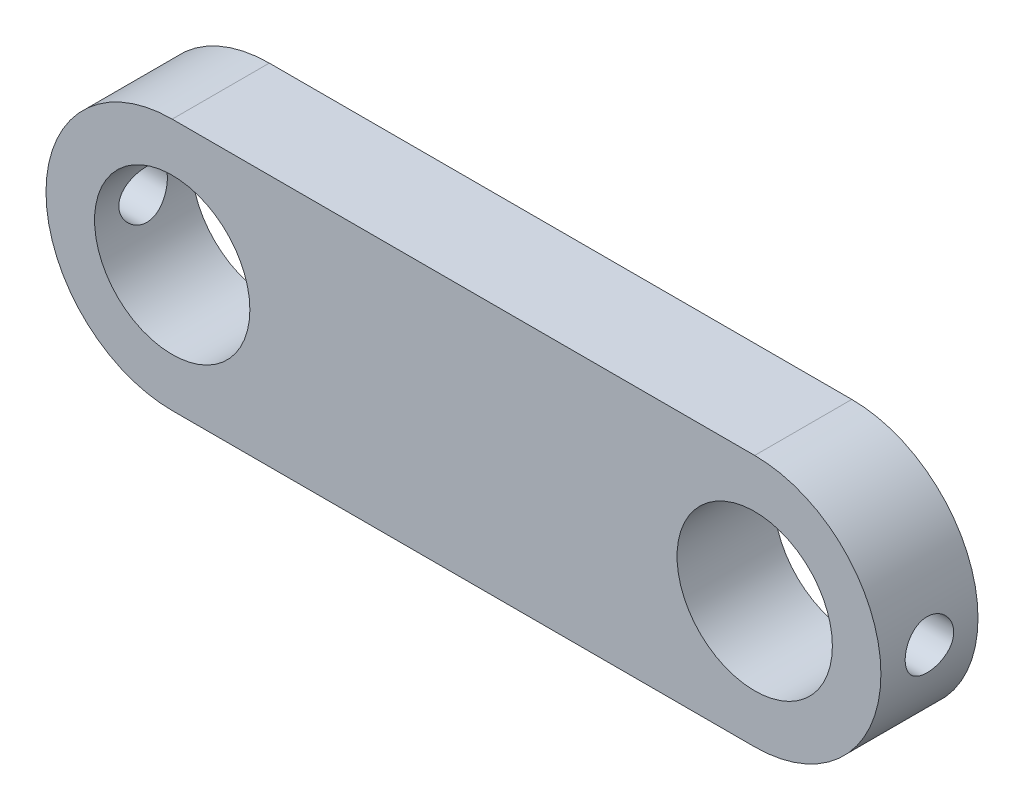
ISO-10303-21;
HEADER;
FILE_DESCRIPTION(('STEP AP214'),'2;1');
FILE_NAME('part.step','',(''),(''),'','','');
FILE_SCHEMA(('AUTOMOTIVE_DESIGN { 1 0 10303 214 1 1 1 1 }'));
ENDSEC;
DATA;
#1=APPLICATION_CONTEXT('core data for automotive mechanical design processes');
#2=APPLICATION_PROTOCOL_DEFINITION('international standard','automotive_design',2000,#1);
#3=PRODUCT_CONTEXT('',#1,'mechanical');
#4=PRODUCT('Part','Part','',(#3));
#5=PRODUCT_RELATED_PRODUCT_CATEGORY('part','',(#4));
#6=PRODUCT_DEFINITION_FORMATION('','',#4);
#7=PRODUCT_DEFINITION_CONTEXT('part definition',#1,'design');
#8=PRODUCT_DEFINITION('design','',#6,#7);
#9=PRODUCT_DEFINITION_SHAPE('','',#8);
#10=(LENGTH_UNIT() NAMED_UNIT(*) SI_UNIT(.MILLI.,.METRE.));
#11=(NAMED_UNIT(*) PLANE_ANGLE_UNIT() SI_UNIT($,.RADIAN.));
#12=(NAMED_UNIT(*) SI_UNIT($,.STERADIAN.) SOLID_ANGLE_UNIT());
#13=UNCERTAINTY_MEASURE_WITH_UNIT(LENGTH_MEASURE(1.E-05),#10,'distance_accuracy_value','');
#14=(GEOMETRIC_REPRESENTATION_CONTEXT(3) GLOBAL_UNCERTAINTY_ASSIGNED_CONTEXT((#13)) GLOBAL_UNIT_ASSIGNED_CONTEXT((#10,
#11,#12)) REPRESENTATION_CONTEXT('',''));
#15=CARTESIAN_POINT('',(0.,0.,0.));
#16=DIRECTION('',(0.,0.,1.));
#17=DIRECTION('',(1.,0.,0.));
#18=AXIS2_PLACEMENT_3D('',#15,#16,#17);
#19=CARTESIAN_POINT('',(-15.,0.,5.));
#20=DIRECTION('',(0.,0.,-1.));
#21=DIRECTION('',(-1.,0.,0.));
#22=AXIS2_PLACEMENT_3D('',#19,#20,#21);
#23=CYLINDRICAL_SURFACE('',#22,6.5);
#24=CARTESIAN_POINT('',(-15.,0.,0.));
#25=DIRECTION('',(0.,0.,1.));
#26=DIRECTION('',(1.,0.,0.));
#27=AXIS2_PLACEMENT_3D('',#24,#25,#26);
#28=CIRCLE('',#27,6.5);
#29=CARTESIAN_POINT('',(-15.,6.5,0.));
#30=VERTEX_POINT('',#29);
#31=CARTESIAN_POINT('',(-15.,-6.5,0.));
#32=VERTEX_POINT('',#31);
#33=EDGE_CURVE('E114',#30,#32,#28,.T.);
#34=ORIENTED_EDGE('',*,*,#33,.T.);
#35=DIRECTION('',(0.,0.,-1.));
#36=VECTOR('',#35,1.);
#37=CARTESIAN_POINT('',(-15.,-6.5,5.));
#38=LINE('',#37,#36);
#39=CARTESIAN_POINT('',(-15.,-6.5,5.));
#40=VERTEX_POINT('',#39);
#41=EDGE_CURVE('E11',#40,#32,#38,.T.);
#42=ORIENTED_EDGE('',*,*,#41,.F.);
#43=CARTESIAN_POINT('',(-15.,0.,5.));
#44=DIRECTION('',(0.,0.,1.));
#45=DIRECTION('',(1.,0.,0.));
#46=AXIS2_PLACEMENT_3D('',#43,#44,#45);
#47=CIRCLE('',#46,6.5);
#48=CARTESIAN_POINT('',(-15.,6.5,5.));
#49=VERTEX_POINT('',#48);
#50=EDGE_CURVE('E101',#49,#40,#47,.T.);
#51=ORIENTED_EDGE('',*,*,#50,.F.);
#52=DIRECTION('',(0.,0.,-1.));
#53=VECTOR('',#52,1.);
#54=CARTESIAN_POINT('',(-15.,6.5,5.));
#55=LINE('',#54,#53);
#56=EDGE_CURVE('E110',#49,#30,#55,.T.);
#57=ORIENTED_EDGE('',*,*,#56,.T.);
#58=EDGE_LOOP('',(#34,#42,#51,#57));
#59=FACE_BOUND('',#58,.T.);
#60=CARTESIAN_POINT('',(-21.5,0.,3.75));
#61=CARTESIAN_POINT('',(-21.4999987305492,0.0695263300903768,3.74999737939015));
#62=CARTESIAN_POINT('',(-21.4988729903498,0.139086386536077,3.744179706351));
#63=CARTESIAN_POINT('',(-21.4944907247803,0.27624406654568,3.72107902756889));
#64=CARTESIAN_POINT('',(-21.4912324409353,0.343840022447299,3.70378655965699));
#65=CARTESIAN_POINT('',(-21.482949324667,0.475066268731186,3.65828720975593));
#66=CARTESIAN_POINT('',(-21.4779261246307,0.538700159856867,3.63009041086318));
#67=CARTESIAN_POINT('',(-21.4666607743919,0.660328619211792,3.56361193603687));
#68=CARTESIAN_POINT('',(-21.4604187129769,0.718323597744222,3.52533099460691));
#69=CARTESIAN_POINT('',(-21.4473161501218,0.82776216487111,3.43926041714611));
#70=CARTESIAN_POINT('',(-21.4404494774308,0.87912464768377,3.39136858427445));
#71=CARTESIAN_POINT('',(-21.4269170680867,0.973138343078084,3.28765548140267));
#72=CARTESIAN_POINT('',(-21.4202513463639,1.01578890972676,3.23183362396171));
#73=CARTESIAN_POINT('',(-21.4078154700976,1.09150839810311,3.1132680023211));
#74=CARTESIAN_POINT('',(-21.4020532663255,1.12449425725113,3.05047028444984));
#75=CARTESIAN_POINT('',(-21.3921640628037,1.17941610157594,2.92009504498672));
#76=CARTESIAN_POINT('',(-21.3880369143487,1.20135309167639,2.85251795872879));
#77=CARTESIAN_POINT('',(-21.3819473506382,1.23329305228569,2.71537190414041));
#78=CARTESIAN_POINT('',(-21.3799592411029,1.24343779395771,2.64583711665146));
#79=CARTESIAN_POINT('',(-21.3782954387972,1.25194545092381,2.50602618154001));
#80=CARTESIAN_POINT('',(-21.3786195277321,1.25030947843596,2.43575010452821));
#81=CARTESIAN_POINT('',(-21.381520129209,1.23541697804277,2.29748238841897));
#82=CARTESIAN_POINT('',(-21.3840652973311,1.22232215325027,2.22947257761762));
#83=CARTESIAN_POINT('',(-21.3910720019511,1.18513854067889,2.09663350844221));
#84=CARTESIAN_POINT('',(-21.3955336237036,1.16104926380166,2.03180439170638));
#85=CARTESIAN_POINT('',(-21.4059030176179,1.10240382729656,1.90669652809025));
#86=CARTESIAN_POINT('',(-21.4118197035363,1.06778282798615,1.846448944746));
#87=CARTESIAN_POINT('',(-21.4244267355315,0.989102525446742,1.73255751443072));
#88=CARTESIAN_POINT('',(-21.431117164025,0.945042216343238,1.67891437220416));
#89=CARTESIAN_POINT('',(-21.4446541190485,0.847864455663344,1.57882073288959));
#90=CARTESIAN_POINT('',(-21.4515013932697,0.794608805779971,1.5325044049816));
#91=CARTESIAN_POINT('',(-21.4644786051449,0.681013328076999,1.44944224634974));
#92=CARTESIAN_POINT('',(-21.4706085348794,0.620673422062245,1.41269652127943));
#93=CARTESIAN_POINT('',(-21.4814737430516,0.494478881244403,1.34979697648017));
#94=CARTESIAN_POINT('',(-21.4862071130317,0.42861685652154,1.32365763269142));
#95=CARTESIAN_POINT('',(-21.4937312360821,0.293325284598563,1.28285128832655));
#96=CARTESIAN_POINT('',(-21.4965222064135,0.223896137321175,1.2681830046674));
#97=CARTESIAN_POINT('',(-21.4998170641524,0.0845949575723145,1.25092311692321));
#98=CARTESIAN_POINT('',(-21.5003557467727,0.0147464889976655,1.24814776407948));
#99=CARTESIAN_POINT('',(-21.4991816499422,-0.124416318296406,1.25425888859832));
#100=CARTESIAN_POINT('',(-21.497468987103,-0.19373068449337,1.26314476195117));
#101=CARTESIAN_POINT('',(-21.4920063435979,-0.329271121290105,1.29217337199751));
#102=CARTESIAN_POINT('',(-21.488273286568,-0.395517951862491,1.31222263921288));
#103=CARTESIAN_POINT('',(-21.4791867724429,-0.523709778000942,1.36290739006222));
#104=CARTESIAN_POINT('',(-21.4738332009406,-0.585654469459844,1.39354362114863));
#105=CARTESIAN_POINT('',(-21.4620127326735,-0.704264341336223,1.46493587158737));
#106=CARTESIAN_POINT('',(-21.4555338112679,-0.76086109263165,1.5058035457684));
#107=CARTESIAN_POINT('',(-21.4422112758938,-0.866459302715511,1.59634811174868));
#108=CARTESIAN_POINT('',(-21.4353676260222,-0.915460011904459,1.64602587191698));
#109=CARTESIAN_POINT('',(-21.4219708191961,-1.00517755082431,1.75361408069801));
#110=CARTESIAN_POINT('',(-21.4154230757864,-1.04576869619256,1.81163012514148));
#111=CARTESIAN_POINT('',(-21.4034705187971,-1.11662974416658,1.93376516213667));
#112=CARTESIAN_POINT('',(-21.398065661437,-1.14690004216186,1.99788392077428));
#113=CARTESIAN_POINT('',(-21.3890537865887,-1.19608442093859,2.13009317947311));
#114=CARTESIAN_POINT('',(-21.385437857926,-1.21505488797638,2.19816206673376));
#115=CARTESIAN_POINT('',(-21.3803934366071,-1.24127395271723,2.33659753660324));
#116=CARTESIAN_POINT('',(-21.3789646827817,-1.24852394995944,2.4069638438537));
#117=CARTESIAN_POINT('',(-21.3784701025323,-1.25104755843674,2.54673667796078));
#118=CARTESIAN_POINT('',(-21.3793651352192,-1.24651955106103,2.61613956148371));
#119=CARTESIAN_POINT('',(-21.3833302398308,-1.2260513326902,2.7531749722532));
#120=CARTESIAN_POINT('',(-21.3864002971257,-1.21011119845592,2.82080751140438));
#121=CARTESIAN_POINT('',(-21.3943526629814,-1.16735673858749,2.952268309921));
#122=CARTESIAN_POINT('',(-21.3992312103349,-1.14056497100194,3.01610414795882));
#123=CARTESIAN_POINT('',(-21.4102533266987,-1.07688985392764,3.13840618094546));
#124=CARTESIAN_POINT('',(-21.4163969914412,-1.04000574067459,3.19687196905446));
#125=CARTESIAN_POINT('',(-21.4293779515137,-0.956507819072142,3.30776578734231));
#126=CARTESIAN_POINT('',(-21.4362246398256,-0.909750049269226,3.36008434074107));
#127=CARTESIAN_POINT('',(-21.4497710158073,-0.808131192425043,3.45619868774715));
#128=CARTESIAN_POINT('',(-21.4564706693519,-0.753268246630374,3.49999252103404));
#129=CARTESIAN_POINT('',(-21.4690432852945,-0.636368128673316,3.57820650842778));
#130=CARTESIAN_POINT('',(-21.4749077450622,-0.574267467434709,3.61253318503457));
#131=CARTESIAN_POINT('',(-21.485065953835,-0.445086129675207,3.67021039618203));
#132=CARTESIAN_POINT('',(-21.4893611549681,-0.378010126647428,3.69357108393445));
#133=CARTESIAN_POINT('',(-21.4950367187511,-0.258961782852772,3.72399229210729));
#134=CARTESIAN_POINT('',(-21.4968872950167,-0.207678719850838,3.73372824487617));
#135=CARTESIAN_POINT('',(-21.4993693947694,-0.104270079257342,3.74673299181852));
#136=CARTESIAN_POINT('',(-21.500000952084,-0.0521445250851635,3.750001965449));
#137=CARTESIAN_POINT('',(-21.5,0.,3.75));
#138=B_SPLINE_CURVE_WITH_KNOTS('',3,(#60,#61,#62,#63,#64,#65,#66,#67,#68,#69,#70,#71,#72,#73,
#74,#75,#76,#77,#78,#79,#80,#81,#82,#83,#84,#85,#86,#87,#88,#89,#90,#91,#92,#93,#94,#95,#96,#97,
#98,#99,#100,#101,#102,#103,#104,#105,#106,#107,#108,#109,#110,#111,#112,#113,#114,#115,#116,
#117,#118,#119,#120,#121,#122,#123,#124,#125,#126,#127,#128,#129,#130,#131,#132,#133,#134,#135,
#136,#137),.UNSPECIFIED.,.T.,.F.,(4,2,2,2,2,2,2,2,2,2,2,2,2,2,2,2,2,2,2,2,2,2,2,2,2,2,2,2,2,2,2,
2,2,2,2,2,2,2,4),(0.,0.208388270286286,0.416948592398258,0.625316520786645,0.833669276372911,
1.0443676620205,1.25508166394262,1.4675568091212,1.68001262563574,1.88988689492414,
2.09974135022729,2.3066813234972,2.51363050358034,2.72188049935154,2.9301526977684,
3.14188196787827,3.35361357524978,3.56563319670022,3.77762909953165,3.98633752849765,
4.19503514754155,4.40201109247083,4.60900165313827,4.81835785477028,5.0277347031462,
5.24004512383251,5.45234741003696,5.66358123272488,5.87478983015679,6.08246408561773,
6.29013694422222,6.49738029642496,6.70463933664288,6.91515952159825,7.12572806013491,
7.33830680136692,7.55068832965364,7.70698320273414,7.8632737386113),.UNSPECIFIED.);
#139=CARTESIAN_POINT('',(-21.5,0.,3.75));
#140=VERTEX_POINT('',#139);
#141=EDGE_CURVE('E130',#140,#140,#138,.T.);
#142=ORIENTED_EDGE('',*,*,#141,.F.);
#143=EDGE_LOOP('',(#142));
#144=FACE_BOUND('',#143,.T.);
#145=ADVANCED_FACE('F41',(#59,#144),#23,.T.);
#146=CARTESIAN_POINT('',(-15.,0.,5.));
#147=DIRECTION('',(0.,0.,-1.));
#148=DIRECTION('',(-1.,0.,0.));
#149=AXIS2_PLACEMENT_3D('',#146,#147,#148);
#150=CYLINDRICAL_SURFACE('',#149,4.);
#151=CARTESIAN_POINT('',(-15.,0.,0.));
#152=DIRECTION('',(0.,0.,1.));
#153=DIRECTION('',(1.,0.,0.));
#154=AXIS2_PLACEMENT_3D('',#151,#152,#153);
#155=CIRCLE('',#154,4.);
#156=CARTESIAN_POINT('',(-11.,0.,0.));
#157=VERTEX_POINT('',#156);
#158=EDGE_CURVE('E249',#157,#157,#155,.T.);
#159=ORIENTED_EDGE('',*,*,#158,.F.);
#160=EDGE_LOOP('',(#159));
#161=FACE_BOUND('',#160,.T.);
#162=CARTESIAN_POINT('',(-15.,0.,5.));
#163=DIRECTION('',(0.,0.,1.));
#164=DIRECTION('',(1.,0.,0.));
#165=AXIS2_PLACEMENT_3D('',#162,#163,#164);
#166=CIRCLE('',#165,4.);
#167=CARTESIAN_POINT('',(-11.,0.,5.));
#168=VERTEX_POINT('',#167);
#169=EDGE_CURVE('E117',#168,#168,#166,.T.);
#170=ORIENTED_EDGE('',*,*,#169,.T.);
#171=EDGE_LOOP('',(#170));
#172=FACE_BOUND('',#171,.T.);
#173=CARTESIAN_POINT('',(-19.,0.,3.75));
#174=CARTESIAN_POINT('',(-18.9999996587799,0.0684391851745465,3.74999955341242));
#175=CARTESIAN_POINT('',(-18.9982269498484,0.136883052502859,3.74436077305555));
#176=CARTESIAN_POINT('',(-18.9913289408881,0.271769209588448,3.72201375846076));
#177=CARTESIAN_POINT('',(-18.9862028819986,0.338211042725907,3.70530301863564));
#178=CARTESIAN_POINT('',(-18.9731581569791,0.467128543650807,3.66143062880426));
#179=CARTESIAN_POINT('',(-18.9652438149902,0.529610176985804,3.63428515534704));
#180=CARTESIAN_POINT('',(-18.9474396916109,0.64913480234646,3.57038268232167));
#181=CARTESIAN_POINT('',(-18.937549598999,0.706176935444885,3.53362416821942));
#182=CARTESIAN_POINT('',(-18.9165021374028,0.814965334952281,3.45034400798264));
#183=CARTESIAN_POINT('',(-18.9053171592699,0.86652002815666,3.40357911493893));
#184=CARTESIAN_POINT('',(-18.8831004637421,0.961197382036994,3.30213160758645));
#185=CARTESIAN_POINT('',(-18.8720687752346,1.0043184728987,3.24744752250546));
#186=CARTESIAN_POINT('',(-18.8511114469817,1.08194336483114,3.13005543619192));
#187=CARTESIAN_POINT('',(-18.841219883018,1.11620784150129,3.06718252247278));
#188=CARTESIAN_POINT('',(-18.8240780179923,1.17359741076672,2.93620768501813));
#189=CARTESIAN_POINT('',(-18.8168270212869,1.19672543771945,2.86810714420607));
#190=CARTESIAN_POINT('',(-18.806076069845,1.23048459930034,2.73077192254794));
#191=CARTESIAN_POINT('',(-18.8024697292951,1.24147110007865,2.66163315636115));
#192=CARTESIAN_POINT('',(-18.7991005514095,1.25174555036988,2.52240688108811));
#193=CARTESIAN_POINT('',(-18.7993366922733,1.25103660995772,2.45231962917834));
#194=CARTESIAN_POINT('',(-18.8035318907544,1.2382182473274,2.31612553973102));
#195=CARTESIAN_POINT('',(-18.8073434174595,1.22656057869383,2.24997087413844));
#196=CARTESIAN_POINT('',(-18.8180202565249,1.19290813355626,2.12060784346266));
#197=CARTESIAN_POINT('',(-18.8248858934311,1.17091225844551,2.0573997922912));
#198=CARTESIAN_POINT('',(-18.841010440143,1.11688874681278,1.93464805556737));
#199=CARTESIAN_POINT('',(-18.8503028466082,1.08471925662082,1.87517138930802));
#200=CARTESIAN_POINT('',(-18.8702185658007,1.01136020737849,1.76231223212088));
#201=CARTESIAN_POINT('',(-18.8808422239455,0.970168305215778,1.70893132974629));
#202=CARTESIAN_POINT('',(-18.9028152780049,0.87771695418213,1.60722505658301));
#203=CARTESIAN_POINT('',(-18.914175696057,0.826084570592823,1.55924044222032));
#204=CARTESIAN_POINT('',(-18.9359157075958,0.715364408095537,1.47252810642032));
#205=CARTESIAN_POINT('',(-18.9462952283837,0.656276077349027,1.43380107078079));
#206=CARTESIAN_POINT('',(-18.9650129489019,0.531664610465461,1.36647231139873));
#207=CARTESIAN_POINT('',(-18.9733346064821,0.466094906919286,1.33795186453603));
#208=CARTESIAN_POINT('',(-18.9868795582855,0.330767977782651,1.29244699914843));
#209=CARTESIAN_POINT('',(-18.9921037932515,0.261012030724615,1.2754590777616));
#210=CARTESIAN_POINT('',(-18.9987138939501,0.122185157290352,1.25408195742102));
#211=CARTESIAN_POINT('',(-19.0002402289544,0.0531918487888492,1.24923145640648));
#212=CARTESIAN_POINT('',(-18.9996979973098,-0.0846303057325781,1.25096622663733));
#213=CARTESIAN_POINT('',(-18.9976299558112,-0.153459174306499,1.2575498273226));
#214=CARTESIAN_POINT('',(-18.9902236376977,-0.287219332975846,1.28159559260639));
#215=CARTESIAN_POINT('',(-18.9849679311072,-0.352204978420942,1.29878326761251));
#216=CARTESIAN_POINT('',(-18.9718012137925,-0.47835192886136,1.34321435236669));
#217=CARTESIAN_POINT('',(-18.963889875142,-0.53951276044901,1.3704590040249));
#218=CARTESIAN_POINT('',(-18.9459854275957,-0.657932406672226,1.43497321654879));
#219=CARTESIAN_POINT('',(-18.9359462681821,-0.715059739787949,1.47247098749722));
#220=CARTESIAN_POINT('',(-18.9149341000289,-0.82236585096009,1.55615321011701));
#221=CARTESIAN_POINT('',(-18.9039608384586,-0.872542738043331,1.60234001774311));
#222=CARTESIAN_POINT('',(-18.8817699488525,-0.966587462919651,1.70425889005368));
#223=CARTESIAN_POINT('',(-18.8705598671445,-1.01012652339773,1.76029666374526));
#224=CARTESIAN_POINT('',(-18.849619470876,-1.08721250244909,1.87912661637074));
#225=CARTESIAN_POINT('',(-18.839889132814,-1.12075957972523,1.94191868800443));
#226=CARTESIAN_POINT('',(-18.8231178236075,-1.1767008348114,2.07234517288586));
#227=CARTESIAN_POINT('',(-18.8160664646803,-1.19913819558885,2.1399596495047));
#228=CARTESIAN_POINT('',(-18.8055117094121,-1.23222894320963,2.27827249332379));
#229=CARTESIAN_POINT('',(-18.8020069630268,-1.2428868141461,2.34896967637131));
#230=CARTESIAN_POINT('',(-18.7990829271249,-1.2517940615754,2.48800408755424));
#231=CARTESIAN_POINT('',(-18.7994860468308,-1.25058279621957,2.55630345381293));
#232=CARTESIAN_POINT('',(-18.8039009047238,-1.23708818129474,2.69167458491918));
#233=CARTESIAN_POINT('',(-18.8079124745732,-1.22480534822559,2.758746406884));
#234=CARTESIAN_POINT('',(-18.8189681415811,-1.18987729913378,2.88879403960178));
#235=CARTESIAN_POINT('',(-18.8259669818347,-1.16738642405944,2.95181544109601));
#236=CARTESIAN_POINT('',(-18.8421970426135,-1.11280227335064,3.07324041353135));
#237=CARTESIAN_POINT('',(-18.8514287171652,-1.08070704444254,3.13164304207768));
#238=CARTESIAN_POINT('',(-18.8715348703158,-1.00635675013475,3.24464597044056));
#239=CARTESIAN_POINT('',(-18.8824594892244,-0.963753335241273,3.29900812950044));
#240=CARTESIAN_POINT('',(-18.9044899882173,-0.870208996404847,3.39998632811179));
#241=CARTESIAN_POINT('',(-18.9155959160679,-0.819265842344402,3.446600288991));
#242=CARTESIAN_POINT('',(-18.9371727195233,-0.708486662823332,3.53228253836299));
#243=CARTESIAN_POINT('',(-18.9476110173063,-0.64841457448738,3.57105473644997));
#244=CARTESIAN_POINT('',(-18.9662676929692,-0.522279138013654,3.63789891513944));
#245=CARTESIAN_POINT('',(-18.9744869431583,-0.456218157795449,3.66597510214183));
#246=CARTESIAN_POINT('',(-18.9872065073346,-0.325747635373978,3.70859136760847));
#247=CARTESIAN_POINT('',(-18.9919624080614,-0.261670337112546,3.72407486730534));
#248=CARTESIAN_POINT('',(-18.9983590034049,-0.131729895440248,3.74477835996771));
#249=CARTESIAN_POINT('',(-19.0000003283964,-0.0658671161396749,3.750000429804));
#250=CARTESIAN_POINT('',(-19.,0.,3.75));
#251=B_SPLINE_CURVE_WITH_KNOTS('',3,(#173,#174,#175,#176,#177,#178,#179,#180,#181,#182,#183,
#184,#185,#186,#187,#188,#189,#190,#191,#192,#193,#194,#195,#196,#197,#198,#199,#200,#201,#202,
#203,#204,#205,#206,#207,#208,#209,#210,#211,#212,#213,#214,#215,#216,#217,#218,#219,#220,#221,
#222,#223,#224,#225,#226,#227,#228,#229,#230,#231,#232,#233,#234,#235,#236,#237,#238,#239,#240,
#241,#242,#243,#244,#245,#246,#247,#248,#249,#250),.UNSPECIFIED.,.T.,.F.,(4,2,2,2,2,2,2,2,2,2,2,
2,2,2,2,2,2,2,2,2,2,2,2,2,2,2,2,2,2,2,2,2,2,2,2,2,2,2,4),(0.,0.20507544943251,0.410197323349066,
0.615002479202436,0.819839921558391,1.03037822195158,1.24095567431276,1.45673771247494,
1.67246286279527,1.8816915016721,2.09086450295138,2.29176917422169,2.49269519979063,
2.69655642720545,2.90047066010358,3.113667472796,3.32688007413303,3.5417546068977,
3.75656384494554,3.96307568548237,4.16955735649363,4.37090626722872,4.572280050345,
4.77856324738343,4.98490245709259,5.1994177871314,5.41392970983712,5.62760115751031,
5.84119123892431,6.04512203476054,6.24904331751085,6.44997913396671,6.65095584330174,
6.85979514006362,7.06869037373341,7.28440668126412,7.50003806666337,7.69744636651541,
7.89481470763048),.UNSPECIFIED.);
#252=CARTESIAN_POINT('',(-19.,0.,3.75));
#253=VERTEX_POINT('',#252);
#254=EDGE_CURVE('E45',#253,#253,#251,.T.);
#255=ORIENTED_EDGE('',*,*,#254,.T.);
#256=EDGE_LOOP('',(#255));
#257=FACE_BOUND('',#256,.T.);
#258=ADVANCED_FACE('F167',(#161,#172,#257),#150,.F.);
#259=CARTESIAN_POINT('',(-15.,0.,5.));
#260=DIRECTION('',(0.,0.,1.));
#261=DIRECTION('',(1.,0.,0.));
#262=AXIS2_PLACEMENT_3D('',#259,#260,#261);
#263=PLANE('',#262);
#264=ORIENTED_EDGE('',*,*,#169,.F.);
#265=EDGE_LOOP('',(#264));
#266=FACE_BOUND('',#265,.T.);
#267=ORIENTED_EDGE('',*,*,#50,.T.);
#268=DIRECTION('',(1.,0.,0.));
#269=VECTOR('',#268,1.);
#270=CARTESIAN_POINT('',(-15.,-6.5,5.));
#271=LINE('',#270,#269);
#272=CARTESIAN_POINT('',(15.,-6.49999999999999,5.));
#273=VERTEX_POINT('',#272);
#274=EDGE_CURVE('E95',#40,#273,#271,.T.);
#275=ORIENTED_EDGE('',*,*,#274,.T.);
#276=CARTESIAN_POINT('',(15.,0.,5.));
#277=DIRECTION('',(0.,0.,1.));
#278=DIRECTION('',(1.,0.,0.));
#279=AXIS2_PLACEMENT_3D('',#276,#277,#278);
#280=CIRCLE('',#279,6.5);
#281=CARTESIAN_POINT('',(15.,6.5,5.));
#282=VERTEX_POINT('',#281);
#283=EDGE_CURVE('E99',#273,#282,#280,.T.);
#284=ORIENTED_EDGE('',*,*,#283,.T.);
#285=DIRECTION('',(-1.,0.,0.));
#286=VECTOR('',#285,1.);
#287=CARTESIAN_POINT('',(-15.,6.5,5.));
#288=LINE('',#287,#286);
#289=EDGE_CURVE('E65',#282,#49,#288,.T.);
#290=ORIENTED_EDGE('',*,*,#289,.T.);
#291=EDGE_LOOP('',(#267,#275,#284,#290));
#292=FACE_BOUND('',#291,.T.);
#293=CARTESIAN_POINT('',(15.,0.,5.));
#294=DIRECTION('',(0.,0.,1.));
#295=DIRECTION('',(1.,0.,0.));
#296=AXIS2_PLACEMENT_3D('',#293,#294,#295);
#297=CIRCLE('',#296,4.);
#298=CARTESIAN_POINT('',(19.,0.,5.));
#299=VERTEX_POINT('',#298);
#300=EDGE_CURVE('E152',#299,#299,#297,.T.);
#301=ORIENTED_EDGE('',*,*,#300,.F.);
#302=EDGE_LOOP('',(#301));
#303=FACE_BOUND('',#302,.T.);
#304=ADVANCED_FACE('F96',(#266,#292,#303),#263,.T.);
#305=CARTESIAN_POINT('',(-15.,0.,0.));
#306=DIRECTION('',(0.,0.,1.));
#307=DIRECTION('',(1.,0.,0.));
#308=AXIS2_PLACEMENT_3D('',#305,#306,#307);
#309=PLANE('',#308);
#310=ORIENTED_EDGE('',*,*,#33,.F.);
#311=DIRECTION('',(-1.,0.,0.));
#312=VECTOR('',#311,1.);
#313=CARTESIAN_POINT('',(-15.,6.5,0.));
#314=LINE('',#313,#312);
#315=CARTESIAN_POINT('',(15.,6.5,0.));
#316=VERTEX_POINT('',#315);
#317=EDGE_CURVE('E88',#316,#30,#314,.T.);
#318=ORIENTED_EDGE('',*,*,#317,.F.);
#319=CARTESIAN_POINT('',(15.,0.,0.));
#320=DIRECTION('',(0.,0.,1.));
#321=DIRECTION('',(1.,0.,0.));
#322=AXIS2_PLACEMENT_3D('',#319,#320,#321);
#323=CIRCLE('',#322,6.5);
#324=CARTESIAN_POINT('',(15.,-6.49999999999999,0.));
#325=VERTEX_POINT('',#324);
#326=EDGE_CURVE('E82',#325,#316,#323,.T.);
#327=ORIENTED_EDGE('',*,*,#326,.F.);
#328=DIRECTION('',(1.,0.,0.));
#329=VECTOR('',#328,1.);
#330=CARTESIAN_POINT('',(-15.,-6.5,0.));
#331=LINE('',#330,#329);
#332=EDGE_CURVE('E105',#32,#325,#331,.T.);
#333=ORIENTED_EDGE('',*,*,#332,.F.);
#334=EDGE_LOOP('',(#310,#318,#327,#333));
#335=FACE_BOUND('',#334,.T.);
#336=ORIENTED_EDGE('',*,*,#158,.T.);
#337=EDGE_LOOP('',(#336));
#338=FACE_BOUND('',#337,.T.);
#339=CARTESIAN_POINT('',(15.,0.,0.));
#340=DIRECTION('',(0.,0.,1.));
#341=DIRECTION('',(1.,0.,0.));
#342=AXIS2_PLACEMENT_3D('',#339,#340,#341);
#343=CIRCLE('',#342,4.);
#344=CARTESIAN_POINT('',(19.,0.,0.));
#345=VERTEX_POINT('',#344);
#346=EDGE_CURVE('E148',#345,#345,#343,.T.);
#347=ORIENTED_EDGE('',*,*,#346,.T.);
#348=EDGE_LOOP('',(#347));
#349=FACE_BOUND('',#348,.T.);
#350=ADVANCED_FACE('F161',(#335,#338,#349),#309,.F.);
#351=CARTESIAN_POINT('',(-15.,-6.5,5.));
#352=DIRECTION('',(0.,1.,0.));
#353=DIRECTION('',(-1.,0.,0.));
#354=AXIS2_PLACEMENT_3D('',#351,#352,#353);
#355=PLANE('',#354);
#356=ORIENTED_EDGE('',*,*,#332,.T.);
#357=DIRECTION('',(0.,0.,-1.));
#358=VECTOR('',#357,1.);
#359=CARTESIAN_POINT('',(15.,-6.49999999999999,5.));
#360=LINE('',#359,#358);
#361=EDGE_CURVE('E56',#273,#325,#360,.T.);
#362=ORIENTED_EDGE('',*,*,#361,.F.);
#363=ORIENTED_EDGE('',*,*,#274,.F.);
#364=ORIENTED_EDGE('',*,*,#41,.T.);
#365=EDGE_LOOP('',(#356,#362,#363,#364));
#366=FACE_BOUND('',#365,.T.);
#367=ADVANCED_FACE('F104',(#366),#355,.F.);
#368=CARTESIAN_POINT('',(15.,0.,5.));
#369=DIRECTION('',(0.,0.,-1.));
#370=DIRECTION('',(-1.,0.,0.));
#371=AXIS2_PLACEMENT_3D('',#368,#369,#370);
#372=CYLINDRICAL_SURFACE('',#371,6.5);
#373=CARTESIAN_POINT('',(21.5,0.,1.25));
#374=CARTESIAN_POINT('',(21.4999987305492,-0.0695263300903712,1.25000262060985));
#375=CARTESIAN_POINT('',(21.4988729903498,-0.139086386536072,1.255820293649));
#376=CARTESIAN_POINT('',(21.4944907247803,-0.276244066545675,1.27892097243111));
#377=CARTESIAN_POINT('',(21.4912324409352,-0.343840022447294,1.29621344034301));
#378=CARTESIAN_POINT('',(21.482949324667,-0.47506626873118,1.34171279024407));
#379=CARTESIAN_POINT('',(21.4779261246306,-0.538700159856862,1.36990958913682));
#380=CARTESIAN_POINT('',(21.4666607743919,-0.660328619211787,1.43638806396313));
#381=CARTESIAN_POINT('',(21.4604187129769,-0.718323597744217,1.47466900539309));
#382=CARTESIAN_POINT('',(21.4473161501218,-0.827762164871105,1.56073958285389));
#383=CARTESIAN_POINT('',(21.4404494774308,-0.879124647683764,1.60863141572555));
#384=CARTESIAN_POINT('',(21.4269170680867,-0.973138343078078,1.71234451859733));
#385=CARTESIAN_POINT('',(21.4202513463639,-1.01578890972675,1.76816637603829));
#386=CARTESIAN_POINT('',(21.4078154700976,-1.0915083981031,1.8867319976789));
#387=CARTESIAN_POINT('',(21.4020532663255,-1.12449425725112,1.94952971555017));
#388=CARTESIAN_POINT('',(21.3921640628037,-1.17941610157593,2.07990495501328));
#389=CARTESIAN_POINT('',(21.3880369143487,-1.20135309167639,2.14748204127121));
#390=CARTESIAN_POINT('',(21.3819473506382,-1.23329305228569,2.28462809585959));
#391=CARTESIAN_POINT('',(21.3799592411029,-1.24343779395771,2.35416288334854));
#392=CARTESIAN_POINT('',(21.3782954387972,-1.2519454509238,2.49397381845999));
#393=CARTESIAN_POINT('',(21.3786195277321,-1.25030947843596,2.56424989547179));
#394=CARTESIAN_POINT('',(21.381520129209,-1.23541697804276,2.70251761158103));
#395=CARTESIAN_POINT('',(21.3840652973311,-1.22232215325026,2.77052742238238));
#396=CARTESIAN_POINT('',(21.3910720019511,-1.18513854067889,2.90336649155779));
#397=CARTESIAN_POINT('',(21.3955336237036,-1.16104926380165,2.96819560829362));
#398=CARTESIAN_POINT('',(21.4059030176179,-1.10240382729656,3.09330347190975));
#399=CARTESIAN_POINT('',(21.4118197035363,-1.06778282798614,3.153551055254));
#400=CARTESIAN_POINT('',(21.4244267355315,-0.989102525446736,3.26744248556928));
#401=CARTESIAN_POINT('',(21.431117164025,-0.945042216343231,3.32108562779584));
#402=CARTESIAN_POINT('',(21.4446541190485,-0.847864455663338,3.42117926711041));
#403=CARTESIAN_POINT('',(21.4515013932697,-0.794608805779964,3.4674955950184));
#404=CARTESIAN_POINT('',(21.4644786051449,-0.681013328076992,3.55055775365026));
#405=CARTESIAN_POINT('',(21.4706085348794,-0.620673422062237,3.58730347872057));
#406=CARTESIAN_POINT('',(21.4814737430516,-0.494478881244395,3.65020302351983));
#407=CARTESIAN_POINT('',(21.4862071130317,-0.428616856521532,3.67634236730858));
#408=CARTESIAN_POINT('',(21.4937312360821,-0.293325284598556,3.71714871167345));
#409=CARTESIAN_POINT('',(21.4965222064135,-0.223896137321168,3.7318169953326));
#410=CARTESIAN_POINT('',(21.4998170641524,-0.084594957572307,3.74907688307679));
#411=CARTESIAN_POINT('',(21.5003557467727,-0.0147464889976581,3.75185223592052));
#412=CARTESIAN_POINT('',(21.4991816499422,0.124416318296413,3.74574111140168));
#413=CARTESIAN_POINT('',(21.497468987103,0.193730684493377,3.73685523804883));
#414=CARTESIAN_POINT('',(21.4920063435979,0.329271121290113,3.70782662800249));
#415=CARTESIAN_POINT('',(21.488273286568,0.395517951862499,3.68777736078712));
#416=CARTESIAN_POINT('',(21.4791867724429,0.52370977800095,3.63709260993778));
#417=CARTESIAN_POINT('',(21.4738332009406,0.585654469459852,3.60645637885137));
#418=CARTESIAN_POINT('',(21.4620127326735,0.704264341336229,3.53506412841263));
#419=CARTESIAN_POINT('',(21.4555338112679,0.760861092631656,3.4941964542316));
#420=CARTESIAN_POINT('',(21.4422112758938,0.866459302715517,3.40365188825132));
#421=CARTESIAN_POINT('',(21.4353676260222,0.915460011904466,3.35397412808302));
#422=CARTESIAN_POINT('',(21.4219708191961,1.00517755082432,3.24638591930199));
#423=CARTESIAN_POINT('',(21.4154230757864,1.04576869619256,3.18836987485852));
#424=CARTESIAN_POINT('',(21.4034705187971,1.11662974416659,3.06623483786333));
#425=CARTESIAN_POINT('',(21.398065661437,1.14690004216187,3.00211607922572));
#426=CARTESIAN_POINT('',(21.3890537865887,1.19608442093859,2.86990682052689));
#427=CARTESIAN_POINT('',(21.385437857926,1.21505488797639,2.80183793326623));
#428=CARTESIAN_POINT('',(21.380393436607,1.24127395271723,2.66340246339676));
#429=CARTESIAN_POINT('',(21.3789646827817,1.24852394995945,2.5930361561463));
#430=CARTESIAN_POINT('',(21.3784701025323,1.25104755843674,2.45326332203922));
#431=CARTESIAN_POINT('',(21.3793651352192,1.24651955106104,2.38386043851629));
#432=CARTESIAN_POINT('',(21.3833302398308,1.22605133269021,2.2468250277468));
#433=CARTESIAN_POINT('',(21.3864002971257,1.21011119845593,2.17919248859562));
#434=CARTESIAN_POINT('',(21.3943526629814,1.1673567385875,2.047731690079));
#435=CARTESIAN_POINT('',(21.3992312103349,1.14056497100194,1.98389585204118));
#436=CARTESIAN_POINT('',(21.4102533266987,1.07688985392764,1.86159381905454));
#437=CARTESIAN_POINT('',(21.4163969914412,1.04000574067459,1.80312803094554));
#438=CARTESIAN_POINT('',(21.4293779515137,0.956507819072147,1.69223421265769));
#439=CARTESIAN_POINT('',(21.4362246398255,0.909750049269231,1.63991565925893));
#440=CARTESIAN_POINT('',(21.4497710158073,0.808131192425048,1.54380131225285));
#441=CARTESIAN_POINT('',(21.4564706693519,0.753268246630378,1.50000747896596));
#442=CARTESIAN_POINT('',(21.4690432852945,0.636368128673321,1.42179349157222));
#443=CARTESIAN_POINT('',(21.4749077450622,0.574267467434714,1.38746681496543));
#444=CARTESIAN_POINT('',(21.485065953835,0.445086129675212,1.32978960381797));
#445=CARTESIAN_POINT('',(21.4893611549681,0.378010126647433,1.30642891606555));
#446=CARTESIAN_POINT('',(21.4950367187511,0.258961782852777,1.27600770789271));
#447=CARTESIAN_POINT('',(21.4968872950167,0.207678719850843,1.26627175512383));
#448=CARTESIAN_POINT('',(21.4993693947694,0.104270079257347,1.25326700818148));
#449=CARTESIAN_POINT('',(21.500000952084,0.0521445250851688,1.249998034551));
#450=CARTESIAN_POINT('',(21.5,0.,1.25));
#451=B_SPLINE_CURVE_WITH_KNOTS('',3,(#373,#374,#375,#376,#377,#378,#379,#380,#381,#382,#383,
#384,#385,#386,#387,#388,#389,#390,#391,#392,#393,#394,#395,#396,#397,#398,#399,#400,#401,#402,
#403,#404,#405,#406,#407,#408,#409,#410,#411,#412,#413,#414,#415,#416,#417,#418,#419,#420,#421,
#422,#423,#424,#425,#426,#427,#428,#429,#430,#431,#432,#433,#434,#435,#436,#437,#438,#439,#440,
#441,#442,#443,#444,#445,#446,#447,#448,#449,#450),.UNSPECIFIED.,.T.,.F.,(4,2,2,2,2,2,2,2,2,2,2,
2,2,2,2,2,2,2,2,2,2,2,2,2,2,2,2,2,2,2,2,2,2,2,2,2,2,2,4),(0.,0.208388270286286,
0.416948592398258,0.625316520786646,0.833669276372911,1.04436766202049,1.25508166394262,
1.46755680912121,1.68001262563574,1.88988689492414,2.09974135022729,2.3066813234972,
2.51363050358034,2.72188049935154,2.9301526977684,3.14188196787827,3.35361357524978,
3.56563319670022,3.77762909953165,3.98633752849765,4.19503514754155,4.40201109247083,
4.60900165313827,4.81835785477027,5.0277347031462,5.24004512383251,5.45234741003696,
5.66358123272488,5.87478983015679,6.08246408561773,6.29013694422222,6.49738029642496,
6.70463933664288,6.91515952159825,7.12572806013492,7.33830680136692,7.55068832965364,
7.70698320273414,7.8632737386113),.UNSPECIFIED.);
#452=CARTESIAN_POINT('',(21.5,0.,1.25));
#453=VERTEX_POINT('',#452);
#454=EDGE_CURVE('E129',#453,#453,#451,.T.);
#455=ORIENTED_EDGE('',*,*,#454,.T.);
#456=EDGE_LOOP('',(#455));
#457=FACE_BOUND('',#456,.T.);
#458=ORIENTED_EDGE('',*,*,#326,.T.);
#459=DIRECTION('',(0.,0.,-1.));
#460=VECTOR('',#459,1.);
#461=CARTESIAN_POINT('',(15.,6.5,5.));
#462=LINE('',#461,#460);
#463=EDGE_CURVE('E106',#282,#316,#462,.T.);
#464=ORIENTED_EDGE('',*,*,#463,.F.);
#465=ORIENTED_EDGE('',*,*,#283,.F.);
#466=ORIENTED_EDGE('',*,*,#361,.T.);
#467=EDGE_LOOP('',(#458,#464,#465,#466));
#468=FACE_BOUND('',#467,.T.);
#469=ADVANCED_FACE('F108',(#457,#468),#372,.T.);
#470=CARTESIAN_POINT('',(-15.,6.5,5.));
#471=DIRECTION('',(0.,-1.,0.));
#472=DIRECTION('',(0.,0.,-1.));
#473=AXIS2_PLACEMENT_3D('',#470,#471,#472);
#474=PLANE('',#473);
#475=ORIENTED_EDGE('',*,*,#317,.T.);
#476=ORIENTED_EDGE('',*,*,#56,.F.);
#477=ORIENTED_EDGE('',*,*,#289,.F.);
#478=ORIENTED_EDGE('',*,*,#463,.T.);
#479=EDGE_LOOP('',(#475,#476,#477,#478));
#480=FACE_BOUND('',#479,.T.);
#481=ADVANCED_FACE('F157',(#480),#474,.F.);
#482=CARTESIAN_POINT('',(15.,0.,5.));
#483=DIRECTION('',(0.,0.,-1.));
#484=DIRECTION('',(-1.,0.,0.));
#485=AXIS2_PLACEMENT_3D('',#482,#483,#484);
#486=CYLINDRICAL_SURFACE('',#485,4.);
#487=CARTESIAN_POINT('',(19.,0.,1.25));
#488=CARTESIAN_POINT('',(18.9999996587799,-0.0684391851745434,1.25000044658758));
#489=CARTESIAN_POINT('',(18.9982269498484,-0.136883052502856,1.25563922694445));
#490=CARTESIAN_POINT('',(18.9913289408881,-0.271769209588445,1.27798624153924));
#491=CARTESIAN_POINT('',(18.9862028819986,-0.338211042725904,1.29469698136436));
#492=CARTESIAN_POINT('',(18.9731581569791,-0.467128543650803,1.33856937119574));
#493=CARTESIAN_POINT('',(18.9652438149902,-0.529610176985801,1.36571484465297));
#494=CARTESIAN_POINT('',(18.9474396916109,-0.649134802346457,1.42961731767833));
#495=CARTESIAN_POINT('',(18.937549598999,-0.706176935444882,1.46637583178059));
#496=CARTESIAN_POINT('',(18.9165021374028,-0.814965334952278,1.54965599201736));
#497=CARTESIAN_POINT('',(18.9053171592699,-0.866520028156657,1.59642088506107));
#498=CARTESIAN_POINT('',(18.8831004637421,-0.96119738203699,1.69786839241355));
#499=CARTESIAN_POINT('',(18.8720687752346,-1.00431847289869,1.75255247749455));
#500=CARTESIAN_POINT('',(18.8511114469817,-1.08194336483113,1.86994456380808));
#501=CARTESIAN_POINT('',(18.841219883018,-1.11620784150128,1.93281747752722));
#502=CARTESIAN_POINT('',(18.8240780179923,-1.17359741076671,2.06379231498187));
#503=CARTESIAN_POINT('',(18.8168270212869,-1.19672543771944,2.13189285579393));
#504=CARTESIAN_POINT('',(18.806076069845,-1.23048459930033,2.26922807745206));
#505=CARTESIAN_POINT('',(18.8024697292951,-1.24147110007864,2.33836684363885));
#506=CARTESIAN_POINT('',(18.7991005514095,-1.25174555036988,2.47759311891189));
#507=CARTESIAN_POINT('',(18.7993366922733,-1.25103660995772,2.54768037082166));
#508=CARTESIAN_POINT('',(18.8035318907544,-1.23821824732739,2.68387446026898));
#509=CARTESIAN_POINT('',(18.8073434174595,-1.22656057869383,2.75002912586156));
#510=CARTESIAN_POINT('',(18.8180202565249,-1.19290813355626,2.87939215653735));
#511=CARTESIAN_POINT('',(18.8248858934311,-1.1709122584455,2.9426002077088));
#512=CARTESIAN_POINT('',(18.841010440143,-1.11688874681277,3.06535194443264));
#513=CARTESIAN_POINT('',(18.8503028466082,-1.08471925662082,3.12482861069198));
#514=CARTESIAN_POINT('',(18.8702185658007,-1.01136020737848,3.23768776787912));
#515=CARTESIAN_POINT('',(18.8808422239455,-0.97016830521577,3.29106867025371));
#516=CARTESIAN_POINT('',(18.9028152780049,-0.877716954182121,3.39277494341699));
#517=CARTESIAN_POINT('',(18.914175696057,-0.826084570592814,3.44075955777968));
#518=CARTESIAN_POINT('',(18.9359157075958,-0.715364408095528,3.52747189357968));
#519=CARTESIAN_POINT('',(18.9462952283837,-0.656276077349018,3.56619892921921));
#520=CARTESIAN_POINT('',(18.9650129489019,-0.531664610465452,3.63352768860128));
#521=CARTESIAN_POINT('',(18.9733346064821,-0.466094906919277,3.66204813546397));
#522=CARTESIAN_POINT('',(18.9868795582855,-0.330767977782642,3.70755300085157));
#523=CARTESIAN_POINT('',(18.9921037932515,-0.261012030724606,3.7245409222384));
#524=CARTESIAN_POINT('',(18.9987138939501,-0.122185157290342,3.74591804257898));
#525=CARTESIAN_POINT('',(19.0002402289544,-0.0531918487888395,3.75076854359352));
#526=CARTESIAN_POINT('',(18.9996979973098,0.0846303057325876,3.74903377336267));
#527=CARTESIAN_POINT('',(18.9976299558112,0.153459174306508,3.7424501726774));
#528=CARTESIAN_POINT('',(18.9902236376977,0.287219332975855,3.71840440739361));
#529=CARTESIAN_POINT('',(18.9849679311072,0.352204978420951,3.70121673238748));
#530=CARTESIAN_POINT('',(18.9718012137925,0.478351928861369,3.65678564763331));
#531=CARTESIAN_POINT('',(18.963889875142,0.539512760449019,3.62954099597509));
#532=CARTESIAN_POINT('',(18.9459854275957,0.657932406672235,3.56502678345121));
#533=CARTESIAN_POINT('',(18.9359462681821,0.715059739787958,3.52752901250278));
#534=CARTESIAN_POINT('',(18.9149341000289,0.822365850960098,3.44384678988298));
#535=CARTESIAN_POINT('',(18.9039608384586,0.872542738043339,3.39765998225689));
#536=CARTESIAN_POINT('',(18.8817699488525,0.96658746291966,3.29574110994631));
#537=CARTESIAN_POINT('',(18.8705598671445,1.01012652339774,3.23970333625474));
#538=CARTESIAN_POINT('',(18.849619470876,1.08721250244909,3.12087338362926));
#539=CARTESIAN_POINT('',(18.839889132814,1.12075957972524,3.05808131199557));
#540=CARTESIAN_POINT('',(18.8231178236075,1.17670083481141,2.92765482711414));
#541=CARTESIAN_POINT('',(18.8160664646803,1.19913819558886,2.8600403504953));
#542=CARTESIAN_POINT('',(18.8055117094121,1.23222894320964,2.7217275066762));
#543=CARTESIAN_POINT('',(18.8020069630267,1.2428868141461,2.65103032362869));
#544=CARTESIAN_POINT('',(18.7990829271249,1.25179406157541,2.51199591244576));
#545=CARTESIAN_POINT('',(18.7994860468308,1.25058279621957,2.44369654618707));
#546=CARTESIAN_POINT('',(18.8039009047238,1.23708818129474,2.30832541508082));
#547=CARTESIAN_POINT('',(18.8079124745732,1.2248053482256,2.241253593116));
#548=CARTESIAN_POINT('',(18.8189681415811,1.18987729913378,2.11120596039822));
#549=CARTESIAN_POINT('',(18.8259669818347,1.16738642405944,2.04818455890399));
#550=CARTESIAN_POINT('',(18.8421970426135,1.11280227335064,1.92675958646865));
#551=CARTESIAN_POINT('',(18.8514287171652,1.08070704444255,1.86835695792232));
#552=CARTESIAN_POINT('',(18.8715348703158,1.00635675013475,1.75535402955944));
#553=CARTESIAN_POINT('',(18.8824594892244,0.963753335241277,1.70099187049956));
#554=CARTESIAN_POINT('',(18.9044899882173,0.870208996404852,1.6000136718882));
#555=CARTESIAN_POINT('',(18.9155959160679,0.819265842344406,1.553399711009));
#556=CARTESIAN_POINT('',(18.9371727195233,0.708486662823336,1.46771746163701));
#557=CARTESIAN_POINT('',(18.9476110173063,0.648414574487383,1.42894526355003));
#558=CARTESIAN_POINT('',(18.9662676929692,0.522279138013657,1.36210108486056));
#559=CARTESIAN_POINT('',(18.9744869431583,0.456218157795452,1.33402489785817));
#560=CARTESIAN_POINT('',(18.9872065073346,0.325747635373981,1.29140863239153));
#561=CARTESIAN_POINT('',(18.9919624080614,0.261670337112549,1.27592513269466));
#562=CARTESIAN_POINT('',(18.9983590034049,0.131729895440251,1.25522164003229));
#563=CARTESIAN_POINT('',(19.0000003283964,0.0658671161396778,1.249999570196));
#564=CARTESIAN_POINT('',(19.,0.,1.25));
#565=B_SPLINE_CURVE_WITH_KNOTS('',3,(#487,#488,#489,#490,#491,#492,#493,#494,#495,#496,#497,
#498,#499,#500,#501,#502,#503,#504,#505,#506,#507,#508,#509,#510,#511,#512,#513,#514,#515,#516,
#517,#518,#519,#520,#521,#522,#523,#524,#525,#526,#527,#528,#529,#530,#531,#532,#533,#534,#535,
#536,#537,#538,#539,#540,#541,#542,#543,#544,#545,#546,#547,#548,#549,#550,#551,#552,#553,#554,
#555,#556,#557,#558,#559,#560,#561,#562,#563,#564),.UNSPECIFIED.,.T.,.F.,(4,2,2,2,2,2,2,2,2,2,2,
2,2,2,2,2,2,2,2,2,2,2,2,2,2,2,2,2,2,2,2,2,2,2,2,2,2,2,4),(0.,0.20507544943251,0.410197323349066,
0.615002479202437,0.819839921558391,1.03037822195158,1.24095567431276,1.45673771247494,
1.67246286279527,1.8816915016721,2.09086450295138,2.29176917422169,2.49269519979063,
2.69655642720545,2.90047066010359,3.113667472796,3.32688007413303,3.5417546068977,
3.75656384494554,3.96307568548237,4.16955735649363,4.37090626722872,4.572280050345,
4.77856324738343,4.98490245709259,5.1994177871314,5.41392970983712,5.62760115751032,
5.84119123892431,6.04512203476054,6.24904331751085,6.44997913396671,6.65095584330174,
6.85979514006362,7.06869037373341,7.28440668126413,7.50003806666338,7.69744636651541,
7.89481470763048),.UNSPECIFIED.);
#566=CARTESIAN_POINT('',(19.,0.,1.25));
#567=VERTEX_POINT('',#566);
#568=EDGE_CURVE('E122',#567,#567,#565,.T.);
#569=ORIENTED_EDGE('',*,*,#568,.F.);
#570=EDGE_LOOP('',(#569));
#571=FACE_BOUND('',#570,.T.);
#572=ORIENTED_EDGE('',*,*,#300,.T.);
#573=EDGE_LOOP('',(#572));
#574=FACE_BOUND('',#573,.T.);
#575=ORIENTED_EDGE('',*,*,#346,.F.);
#576=EDGE_LOOP('',(#575));
#577=FACE_BOUND('',#576,.T.);
#578=ADVANCED_FACE('F131',(#571,#574,#577),#486,.F.);
#579=CARTESIAN_POINT('',(16.5,0.,2.5));
#580=DIRECTION('',(1.,0.,0.));
#581=DIRECTION('',(0.,0.,-1.));
#582=AXIS2_PLACEMENT_3D('',#579,#580,#581);
#583=CYLINDRICAL_SURFACE('',#582,1.25);
#584=ORIENTED_EDGE('',*,*,#568,.T.);
#585=EDGE_LOOP('',(#584));
#586=FACE_BOUND('',#585,.T.);
#587=ORIENTED_EDGE('',*,*,#454,.F.);
#588=EDGE_LOOP('',(#587));
#589=FACE_BOUND('',#588,.T.);
#590=ADVANCED_FACE('F133',(#586,#589),#583,.F.);
#591=CARTESIAN_POINT('',(-16.5,0.,2.5));
#592=DIRECTION('',(-1.,0.,0.));
#593=DIRECTION('',(0.,0.,1.));
#594=AXIS2_PLACEMENT_3D('',#591,#592,#593);
#595=CYLINDRICAL_SURFACE('',#594,1.25);
#596=ORIENTED_EDGE('',*,*,#254,.F.);
#597=EDGE_LOOP('',(#596));
#598=FACE_BOUND('',#597,.T.);
#599=ORIENTED_EDGE('',*,*,#141,.T.);
#600=EDGE_LOOP('',(#599));
#601=FACE_BOUND('',#600,.T.);
#602=ADVANCED_FACE('F136',(#598,#601),#595,.F.);
#603=CLOSED_SHELL('',(#145,#258,#304,#350,#367,#469,#481,#578,#590,#602));
#604=MANIFOLD_SOLID_BREP('B2',#603);
#605=ADVANCED_BREP_SHAPE_REPRESENTATION('',(#18,#604),#14);
#606=SHAPE_DEFINITION_REPRESENTATION(#9,#605);
ENDSEC;
END-ISO-10303-21;
